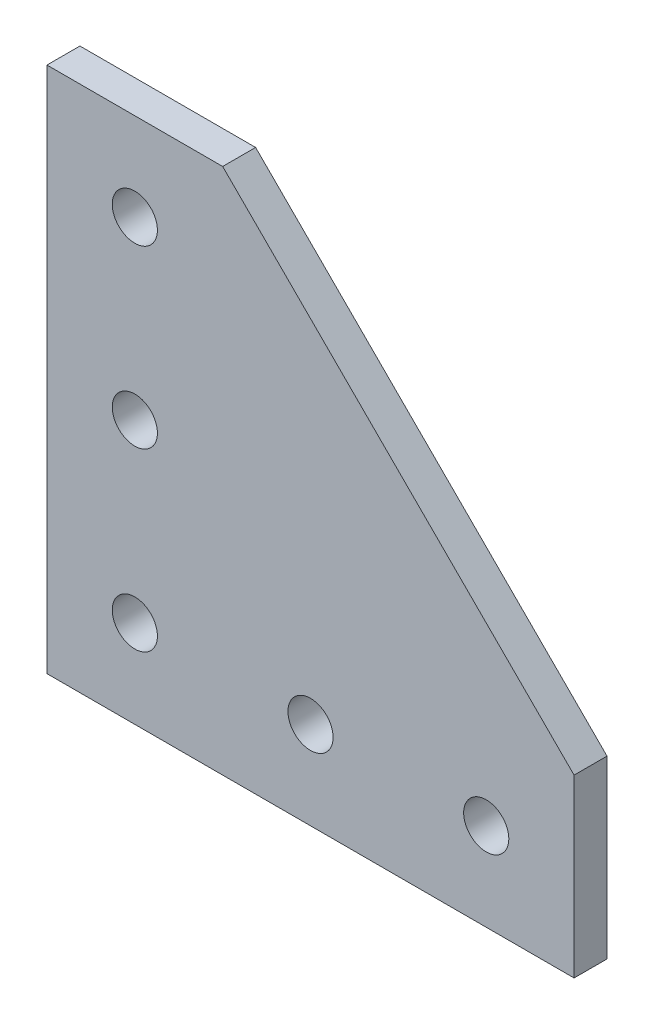
ISO-10303-21;
HEADER;
FILE_DESCRIPTION(('STEP AP214'),'2;1');
FILE_NAME('part.step','',(''),(''),'','','');
FILE_SCHEMA(('AUTOMOTIVE_DESIGN { 1 0 10303 214 1 1 1 1 }'));
ENDSEC;
DATA;
#1=APPLICATION_CONTEXT('core data for automotive mechanical design processes');
#2=APPLICATION_PROTOCOL_DEFINITION('international standard','automotive_design',2000,#1);
#3=PRODUCT_CONTEXT('',#1,'mechanical');
#4=PRODUCT('Part','Part','',(#3));
#5=PRODUCT_RELATED_PRODUCT_CATEGORY('part','',(#4));
#6=PRODUCT_DEFINITION_FORMATION('','',#4);
#7=PRODUCT_DEFINITION_CONTEXT('part definition',#1,'design');
#8=PRODUCT_DEFINITION('design','',#6,#7);
#9=PRODUCT_DEFINITION_SHAPE('','',#8);
#10=(LENGTH_UNIT() NAMED_UNIT(*) SI_UNIT(.MILLI.,.METRE.));
#11=(NAMED_UNIT(*) PLANE_ANGLE_UNIT() SI_UNIT($,.RADIAN.));
#12=(NAMED_UNIT(*) SI_UNIT($,.STERADIAN.) SOLID_ANGLE_UNIT());
#13=UNCERTAINTY_MEASURE_WITH_UNIT(LENGTH_MEASURE(1.E-05),#10,'distance_accuracy_value','');
#14=(GEOMETRIC_REPRESENTATION_CONTEXT(3) GLOBAL_UNCERTAINTY_ASSIGNED_CONTEXT((#13)) GLOBAL_UNIT_ASSIGNED_CONTEXT((#10,
#11,#12)) REPRESENTATION_CONTEXT('',''));
#15=CARTESIAN_POINT('',(0.,0.,0.));
#16=DIRECTION('',(0.,0.,1.));
#17=DIRECTION('',(1.,0.,0.));
#18=AXIS2_PLACEMENT_3D('',#15,#16,#17);
#19=CARTESIAN_POINT('',(0.,0.,2.38125));
#20=DIRECTION('',(0.,0.,-1.));
#21=DIRECTION('',(-1.,0.,0.));
#22=AXIS2_PLACEMENT_3D('',#19,#20,#21);
#23=PLANE('',#22);
#24=CARTESIAN_POINT('',(12.7,63.5,2.38125));
#25=DIRECTION('',(0.,0.,1.));
#26=DIRECTION('',(1.,0.,0.));
#27=AXIS2_PLACEMENT_3D('',#24,#25,#26);
#28=CIRCLE('',#27,3.2639);
#29=CARTESIAN_POINT('',(15.9639,63.5,2.38125));
#30=VERTEX_POINT('',#29);
#31=EDGE_CURVE('E176',#30,#30,#28,.T.);
#32=ORIENTED_EDGE('',*,*,#31,.F.);
#33=EDGE_LOOP('',(#32));
#34=FACE_BOUND('',#33,.T.);
#35=CARTESIAN_POINT('',(38.1,12.7,2.38125));
#36=DIRECTION('',(0.,0.,1.));
#37=DIRECTION('',(1.,0.,0.));
#38=AXIS2_PLACEMENT_3D('',#35,#36,#37);
#39=CIRCLE('',#38,3.26389999999999);
#40=CARTESIAN_POINT('',(41.3639,12.7,2.38125));
#41=VERTEX_POINT('',#40);
#42=EDGE_CURVE('E188',#41,#41,#39,.T.);
#43=ORIENTED_EDGE('',*,*,#42,.F.);
#44=EDGE_LOOP('',(#43));
#45=FACE_BOUND('',#44,.T.);
#46=DIRECTION('',(1.,0.,0.));
#47=VECTOR('',#46,1.);
#48=CARTESIAN_POINT('',(76.2,0.,2.38125));
#49=LINE('',#48,#47);
#50=CARTESIAN_POINT('',(0.,0.,2.38125));
#51=VERTEX_POINT('',#50);
#52=CARTESIAN_POINT('',(76.2,0.,2.38125));
#53=VERTEX_POINT('',#52);
#54=EDGE_CURVE('E116',#51,#53,#49,.T.);
#55=ORIENTED_EDGE('',*,*,#54,.T.);
#56=DIRECTION('',(0.,1.,0.));
#57=VECTOR('',#56,1.);
#58=CARTESIAN_POINT('',(76.2,25.4,2.38125));
#59=LINE('',#58,#57);
#60=CARTESIAN_POINT('',(76.2,25.4,2.38125));
#61=VERTEX_POINT('',#60);
#62=EDGE_CURVE('E83',#53,#61,#59,.T.);
#63=ORIENTED_EDGE('',*,*,#62,.T.);
#64=DIRECTION('',(-0.707106781186547,0.707106781186547,0.));
#65=VECTOR('',#64,1.);
#66=CARTESIAN_POINT('',(76.2,25.4,2.38125));
#67=LINE('',#66,#65);
#68=CARTESIAN_POINT('',(25.4,76.2,2.38125));
#69=VERTEX_POINT('',#68);
#70=EDGE_CURVE('E87',#61,#69,#67,.T.);
#71=ORIENTED_EDGE('',*,*,#70,.T.);
#72=DIRECTION('',(-1.,0.,0.));
#73=VECTOR('',#72,1.);
#74=CARTESIAN_POINT('',(0.,76.2,2.38125));
#75=LINE('',#74,#73);
#76=CARTESIAN_POINT('',(0.,76.2,2.38125));
#77=VERTEX_POINT('',#76);
#78=EDGE_CURVE('E91',#69,#77,#75,.T.);
#79=ORIENTED_EDGE('',*,*,#78,.T.);
#80=DIRECTION('',(0.,-1.,0.));
#81=VECTOR('',#80,1.);
#82=CARTESIAN_POINT('',(0.,0.,2.38125));
#83=LINE('',#82,#81);
#84=EDGE_CURVE('E49',#77,#51,#83,.T.);
#85=ORIENTED_EDGE('',*,*,#84,.T.);
#86=EDGE_LOOP('',(#55,#63,#71,#79,#85));
#87=FACE_BOUND('',#86,.T.);
#88=CARTESIAN_POINT('',(12.7,12.7,2.38125));
#89=DIRECTION('',(0.,0.,1.));
#90=DIRECTION('',(1.,0.,0.));
#91=AXIS2_PLACEMENT_3D('',#88,#89,#90);
#92=CIRCLE('',#91,3.2639);
#93=CARTESIAN_POINT('',(15.9639,12.7,2.38125));
#94=VERTEX_POINT('',#93);
#95=EDGE_CURVE('E111',#94,#94,#92,.T.);
#96=ORIENTED_EDGE('',*,*,#95,.F.);
#97=EDGE_LOOP('',(#96));
#98=FACE_BOUND('',#97,.T.);
#99=CARTESIAN_POINT('',(63.5,12.7,2.38125));
#100=DIRECTION('',(0.,0.,1.));
#101=DIRECTION('',(1.,0.,0.));
#102=AXIS2_PLACEMENT_3D('',#99,#100,#101);
#103=CIRCLE('',#102,3.26389999999999);
#104=CARTESIAN_POINT('',(66.7639,12.7,2.38125));
#105=VERTEX_POINT('',#104);
#106=EDGE_CURVE('E182',#105,#105,#103,.T.);
#107=ORIENTED_EDGE('',*,*,#106,.F.);
#108=EDGE_LOOP('',(#107));
#109=FACE_BOUND('',#108,.T.);
#110=CARTESIAN_POINT('',(12.7,38.1,2.38125));
#111=DIRECTION('',(0.,0.,1.));
#112=DIRECTION('',(1.,0.,0.));
#113=AXIS2_PLACEMENT_3D('',#110,#111,#112);
#114=CIRCLE('',#113,3.26389999999999);
#115=CARTESIAN_POINT('',(15.9639,38.1,2.38125));
#116=VERTEX_POINT('',#115);
#117=EDGE_CURVE('E167',#116,#116,#114,.T.);
#118=ORIENTED_EDGE('',*,*,#117,.F.);
#119=EDGE_LOOP('',(#118));
#120=FACE_BOUND('',#119,.T.);
#121=ADVANCED_FACE('F32',(#34,#45,#87,#98,#109,#120),#23,.F.);
#122=CARTESIAN_POINT('',(0.,0.,-2.38125));
#123=DIRECTION('',(0.,0.,-1.));
#124=DIRECTION('',(-1.,0.,0.));
#125=AXIS2_PLACEMENT_3D('',#122,#123,#124);
#126=PLANE('',#125);
#127=CARTESIAN_POINT('',(12.7,63.5,-2.38125));
#128=DIRECTION('',(0.,0.,1.));
#129=DIRECTION('',(1.,0.,0.));
#130=AXIS2_PLACEMENT_3D('',#127,#128,#129);
#131=CIRCLE('',#130,3.2639);
#132=CARTESIAN_POINT('',(15.9639,63.5,-2.38125));
#133=VERTEX_POINT('',#132);
#134=EDGE_CURVE('E173',#133,#133,#131,.T.);
#135=ORIENTED_EDGE('',*,*,#134,.T.);
#136=EDGE_LOOP('',(#135));
#137=FACE_BOUND('',#136,.T.);
#138=CARTESIAN_POINT('',(38.1,12.7,-2.38125));
#139=DIRECTION('',(0.,0.,1.));
#140=DIRECTION('',(1.,0.,0.));
#141=AXIS2_PLACEMENT_3D('',#138,#139,#140);
#142=CIRCLE('',#141,3.26389999999999);
#143=CARTESIAN_POINT('',(41.3639,12.7,-2.38125));
#144=VERTEX_POINT('',#143);
#145=EDGE_CURVE('E185',#144,#144,#142,.T.);
#146=ORIENTED_EDGE('',*,*,#145,.T.);
#147=EDGE_LOOP('',(#146));
#148=FACE_BOUND('',#147,.T.);
#149=DIRECTION('',(1.,0.,0.));
#150=VECTOR('',#149,1.);
#151=CARTESIAN_POINT('',(76.2,0.,-2.38125));
#152=LINE('',#151,#150);
#153=CARTESIAN_POINT('',(0.,0.,-2.38125));
#154=VERTEX_POINT('',#153);
#155=CARTESIAN_POINT('',(76.2,0.,-2.38125));
#156=VERTEX_POINT('',#155);
#157=EDGE_CURVE('E107',#154,#156,#152,.T.);
#158=ORIENTED_EDGE('',*,*,#157,.F.);
#159=DIRECTION('',(0.,-1.,0.));
#160=VECTOR('',#159,1.);
#161=CARTESIAN_POINT('',(0.,0.,-2.38125));
#162=LINE('',#161,#160);
#163=CARTESIAN_POINT('',(0.,76.2,-2.38125));
#164=VERTEX_POINT('',#163);
#165=EDGE_CURVE('E75',#164,#154,#162,.T.);
#166=ORIENTED_EDGE('',*,*,#165,.F.);
#167=DIRECTION('',(-1.,0.,0.));
#168=VECTOR('',#167,1.);
#169=CARTESIAN_POINT('',(0.,76.2,-2.38125));
#170=LINE('',#169,#168);
#171=CARTESIAN_POINT('',(25.4,76.2,-2.38125));
#172=VERTEX_POINT('',#171);
#173=EDGE_CURVE('E69',#172,#164,#170,.T.);
#174=ORIENTED_EDGE('',*,*,#173,.F.);
#175=DIRECTION('',(-0.707106781186547,0.707106781186547,0.));
#176=VECTOR('',#175,1.);
#177=CARTESIAN_POINT('',(76.2,25.4,-2.38125));
#178=LINE('',#177,#176);
#179=CARTESIAN_POINT('',(76.2,25.4,-2.38125));
#180=VERTEX_POINT('',#179);
#181=EDGE_CURVE('E98',#180,#172,#178,.T.);
#182=ORIENTED_EDGE('',*,*,#181,.F.);
#183=DIRECTION('',(0.,1.,0.));
#184=VECTOR('',#183,1.);
#185=CARTESIAN_POINT('',(76.2,25.4,-2.38125));
#186=LINE('',#185,#184);
#187=EDGE_CURVE('E110',#156,#180,#186,.T.);
#188=ORIENTED_EDGE('',*,*,#187,.F.);
#189=EDGE_LOOP('',(#158,#166,#174,#182,#188));
#190=FACE_BOUND('',#189,.T.);
#191=CARTESIAN_POINT('',(12.7,12.7,-2.38125));
#192=DIRECTION('',(0.,0.,1.));
#193=DIRECTION('',(1.,0.,0.));
#194=AXIS2_PLACEMENT_3D('',#191,#192,#193);
#195=CIRCLE('',#194,3.2639);
#196=CARTESIAN_POINT('',(15.9639,12.7,-2.38125));
#197=VERTEX_POINT('',#196);
#198=EDGE_CURVE('E191',#197,#197,#195,.T.);
#199=ORIENTED_EDGE('',*,*,#198,.T.);
#200=EDGE_LOOP('',(#199));
#201=FACE_BOUND('',#200,.T.);
#202=CARTESIAN_POINT('',(63.5,12.7,-2.38125));
#203=DIRECTION('',(0.,0.,1.));
#204=DIRECTION('',(1.,0.,0.));
#205=AXIS2_PLACEMENT_3D('',#202,#203,#204);
#206=CIRCLE('',#205,3.26389999999999);
#207=CARTESIAN_POINT('',(66.7639,12.7,-2.38125));
#208=VERTEX_POINT('',#207);
#209=EDGE_CURVE('E179',#208,#208,#206,.T.);
#210=ORIENTED_EDGE('',*,*,#209,.T.);
#211=EDGE_LOOP('',(#210));
#212=FACE_BOUND('',#211,.T.);
#213=CARTESIAN_POINT('',(12.7,38.1,-2.38125));
#214=DIRECTION('',(0.,0.,1.));
#215=DIRECTION('',(1.,0.,0.));
#216=AXIS2_PLACEMENT_3D('',#213,#214,#215);
#217=CIRCLE('',#216,3.26389999999999);
#218=CARTESIAN_POINT('',(15.9639,38.1,-2.38125));
#219=VERTEX_POINT('',#218);
#220=EDGE_CURVE('E170',#219,#219,#217,.T.);
#221=ORIENTED_EDGE('',*,*,#220,.T.);
#222=EDGE_LOOP('',(#221));
#223=FACE_BOUND('',#222,.T.);
#224=ADVANCED_FACE('F120',(#137,#148,#190,#201,#212,#223),#126,.T.);
#225=CARTESIAN_POINT('',(76.2,0.,2.38125));
#226=DIRECTION('',(0.,1.,0.));
#227=DIRECTION('',(-1.,0.,0.));
#228=AXIS2_PLACEMENT_3D('',#225,#226,#227);
#229=PLANE('',#228);
#230=ORIENTED_EDGE('',*,*,#157,.T.);
#231=DIRECTION('',(0.,0.,-1.));
#232=VECTOR('',#231,1.);
#233=CARTESIAN_POINT('',(76.2,0.,2.38125));
#234=LINE('',#233,#232);
#235=EDGE_CURVE('E11',#53,#156,#234,.T.);
#236=ORIENTED_EDGE('',*,*,#235,.F.);
#237=ORIENTED_EDGE('',*,*,#54,.F.);
#238=DIRECTION('',(0.,0.,-1.));
#239=VECTOR('',#238,1.);
#240=CARTESIAN_POINT('',(0.,0.,2.38125));
#241=LINE('',#240,#239);
#242=EDGE_CURVE('E103',#51,#154,#241,.T.);
#243=ORIENTED_EDGE('',*,*,#242,.T.);
#244=EDGE_LOOP('',(#230,#236,#237,#243));
#245=FACE_BOUND('',#244,.T.);
#246=ADVANCED_FACE('F34',(#245),#229,.F.);
#247=CARTESIAN_POINT('',(76.2,25.4,2.38125));
#248=DIRECTION('',(-1.,0.,0.));
#249=DIRECTION('',(0.,0.,1.));
#250=AXIS2_PLACEMENT_3D('',#247,#248,#249);
#251=PLANE('',#250);
#252=ORIENTED_EDGE('',*,*,#187,.T.);
#253=DIRECTION('',(0.,0.,-1.));
#254=VECTOR('',#253,1.);
#255=CARTESIAN_POINT('',(76.2,25.4,2.38125));
#256=LINE('',#255,#254);
#257=EDGE_CURVE('E41',#61,#180,#256,.T.);
#258=ORIENTED_EDGE('',*,*,#257,.F.);
#259=ORIENTED_EDGE('',*,*,#62,.F.);
#260=ORIENTED_EDGE('',*,*,#235,.T.);
#261=EDGE_LOOP('',(#252,#258,#259,#260));
#262=FACE_BOUND('',#261,.T.);
#263=ADVANCED_FACE('F248',(#262),#251,.F.);
#264=CARTESIAN_POINT('',(76.2,25.4,2.38125));
#265=DIRECTION('',(-0.707106781186547,-0.707106781186547,0.));
#266=DIRECTION('',(0.707106781186548,-0.707106781186548,0.));
#267=AXIS2_PLACEMENT_3D('',#264,#265,#266);
#268=PLANE('',#267);
#269=ORIENTED_EDGE('',*,*,#181,.T.);
#270=DIRECTION('',(0.,0.,-1.));
#271=VECTOR('',#270,1.);
#272=CARTESIAN_POINT('',(25.4,76.2,2.38125));
#273=LINE('',#272,#271);
#274=EDGE_CURVE('E95',#69,#172,#273,.T.);
#275=ORIENTED_EDGE('',*,*,#274,.F.);
#276=ORIENTED_EDGE('',*,*,#70,.F.);
#277=ORIENTED_EDGE('',*,*,#257,.T.);
#278=EDGE_LOOP('',(#269,#275,#276,#277));
#279=FACE_BOUND('',#278,.T.);
#280=ADVANCED_FACE('F96',(#279),#268,.F.);
#281=CARTESIAN_POINT('',(0.,76.2,2.38125));
#282=DIRECTION('',(0.,-1.,0.));
#283=DIRECTION('',(0.,0.,-1.));
#284=AXIS2_PLACEMENT_3D('',#281,#282,#283);
#285=PLANE('',#284);
#286=ORIENTED_EDGE('',*,*,#173,.T.);
#287=DIRECTION('',(0.,0.,-1.));
#288=VECTOR('',#287,1.);
#289=CARTESIAN_POINT('',(0.,76.2,2.38125));
#290=LINE('',#289,#288);
#291=EDGE_CURVE('E99',#77,#164,#290,.T.);
#292=ORIENTED_EDGE('',*,*,#291,.F.);
#293=ORIENTED_EDGE('',*,*,#78,.F.);
#294=ORIENTED_EDGE('',*,*,#274,.T.);
#295=EDGE_LOOP('',(#286,#292,#293,#294));
#296=FACE_BOUND('',#295,.T.);
#297=ADVANCED_FACE('F101',(#296),#285,.F.);
#298=CARTESIAN_POINT('',(0.,0.,2.38125));
#299=DIRECTION('',(1.,0.,0.));
#300=DIRECTION('',(0.,0.,-1.));
#301=AXIS2_PLACEMENT_3D('',#298,#299,#300);
#302=PLANE('',#301);
#303=ORIENTED_EDGE('',*,*,#165,.T.);
#304=ORIENTED_EDGE('',*,*,#242,.F.);
#305=ORIENTED_EDGE('',*,*,#84,.F.);
#306=ORIENTED_EDGE('',*,*,#291,.T.);
#307=EDGE_LOOP('',(#303,#304,#305,#306));
#308=FACE_BOUND('',#307,.T.);
#309=ADVANCED_FACE('F125',(#308),#302,.F.);
#310=CARTESIAN_POINT('',(12.7,12.7,2.38125));
#311=DIRECTION('',(0.,0.,-1.));
#312=DIRECTION('',(-1.,0.,0.));
#313=AXIS2_PLACEMENT_3D('',#310,#311,#312);
#314=CYLINDRICAL_SURFACE('',#313,3.2639);
#315=ORIENTED_EDGE('',*,*,#95,.T.);
#316=EDGE_LOOP('',(#315));
#317=FACE_BOUND('',#316,.T.);
#318=ORIENTED_EDGE('',*,*,#198,.F.);
#319=EDGE_LOOP('',(#318));
#320=FACE_BOUND('',#319,.T.);
#321=ADVANCED_FACE('F127',(#317,#320),#314,.F.);
#322=CARTESIAN_POINT('',(38.1,12.7,2.38125));
#323=DIRECTION('',(0.,0.,-1.));
#324=DIRECTION('',(-1.,0.,0.));
#325=AXIS2_PLACEMENT_3D('',#322,#323,#324);
#326=CYLINDRICAL_SURFACE('',#325,3.26389999999999);
#327=ORIENTED_EDGE('',*,*,#42,.T.);
#328=EDGE_LOOP('',(#327));
#329=FACE_BOUND('',#328,.T.);
#330=ORIENTED_EDGE('',*,*,#145,.F.);
#331=EDGE_LOOP('',(#330));
#332=FACE_BOUND('',#331,.T.);
#333=ADVANCED_FACE('F133',(#329,#332),#326,.F.);
#334=CARTESIAN_POINT('',(63.5,12.7,2.38125));
#335=DIRECTION('',(0.,0.,-1.));
#336=DIRECTION('',(-1.,0.,0.));
#337=AXIS2_PLACEMENT_3D('',#334,#335,#336);
#338=CYLINDRICAL_SURFACE('',#337,3.26389999999999);
#339=ORIENTED_EDGE('',*,*,#106,.T.);
#340=EDGE_LOOP('',(#339));
#341=FACE_BOUND('',#340,.T.);
#342=ORIENTED_EDGE('',*,*,#209,.F.);
#343=EDGE_LOOP('',(#342));
#344=FACE_BOUND('',#343,.T.);
#345=ADVANCED_FACE('F150',(#341,#344),#338,.F.);
#346=CARTESIAN_POINT('',(12.7,63.5,2.38125));
#347=DIRECTION('',(0.,0.,-1.));
#348=DIRECTION('',(-1.,0.,0.));
#349=AXIS2_PLACEMENT_3D('',#346,#347,#348);
#350=CYLINDRICAL_SURFACE('',#349,3.2639);
#351=ORIENTED_EDGE('',*,*,#31,.T.);
#352=EDGE_LOOP('',(#351));
#353=FACE_BOUND('',#352,.T.);
#354=ORIENTED_EDGE('',*,*,#134,.F.);
#355=EDGE_LOOP('',(#354));
#356=FACE_BOUND('',#355,.T.);
#357=ADVANCED_FACE('F154',(#353,#356),#350,.F.);
#358=CARTESIAN_POINT('',(12.7,38.1,2.38125));
#359=DIRECTION('',(0.,0.,-1.));
#360=DIRECTION('',(-1.,0.,0.));
#361=AXIS2_PLACEMENT_3D('',#358,#359,#360);
#362=CYLINDRICAL_SURFACE('',#361,3.26389999999999);
#363=ORIENTED_EDGE('',*,*,#117,.T.);
#364=EDGE_LOOP('',(#363));
#365=FACE_BOUND('',#364,.T.);
#366=ORIENTED_EDGE('',*,*,#220,.F.);
#367=EDGE_LOOP('',(#366));
#368=FACE_BOUND('',#367,.T.);
#369=ADVANCED_FACE('F158',(#365,#368),#362,.F.);
#370=CLOSED_SHELL('',(#121,#224,#246,#263,#280,#297,#309,#321,#333,#345,#357,#369));
#371=MANIFOLD_SOLID_BREP('B2',#370);
#372=ADVANCED_BREP_SHAPE_REPRESENTATION('',(#18,#371),#14);
#373=SHAPE_DEFINITION_REPRESENTATION(#9,#372);
ENDSEC;
END-ISO-10303-21;
